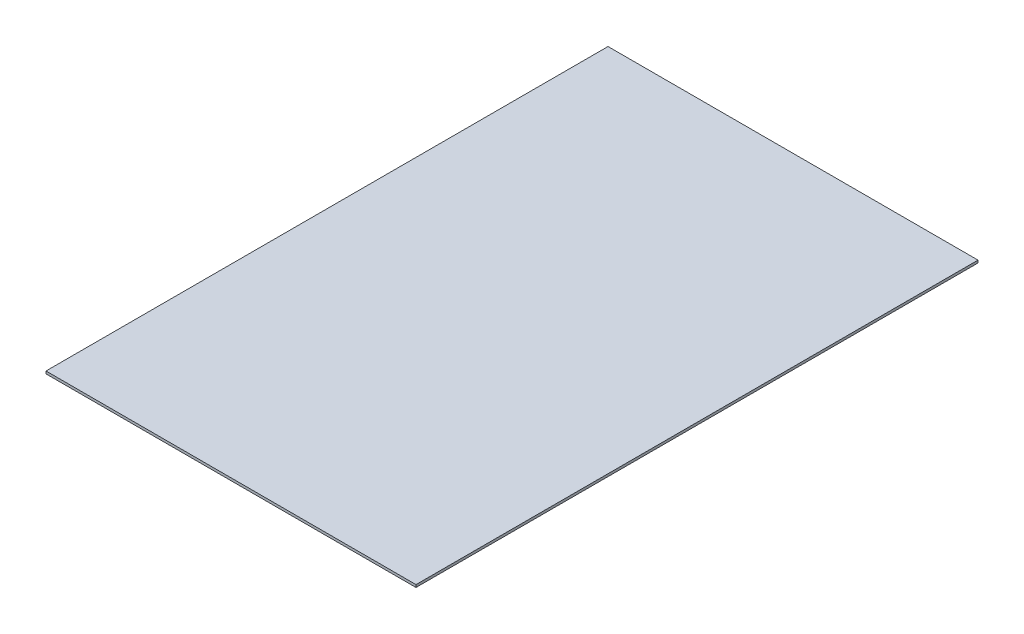
ISO-10303-21;
HEADER;
FILE_DESCRIPTION(('STEP AP214'),'2;1');
FILE_NAME('part.step','',(''),(''),'','','');
FILE_SCHEMA(('AUTOMOTIVE_DESIGN { 1 0 10303 214 1 1 1 1 }'));
ENDSEC;
DATA;
#1=APPLICATION_CONTEXT('core data for automotive mechanical design processes');
#2=APPLICATION_PROTOCOL_DEFINITION('international standard','automotive_design',2000,#1);
#3=PRODUCT_CONTEXT('',#1,'mechanical');
#4=PRODUCT('Part','Part','',(#3));
#5=PRODUCT_RELATED_PRODUCT_CATEGORY('part','',(#4));
#6=PRODUCT_DEFINITION_FORMATION('','',#4);
#7=PRODUCT_DEFINITION_CONTEXT('part definition',#1,'design');
#8=PRODUCT_DEFINITION('design','',#6,#7);
#9=PRODUCT_DEFINITION_SHAPE('','',#8);
#10=(LENGTH_UNIT() NAMED_UNIT(*) SI_UNIT(.MILLI.,.METRE.));
#11=(NAMED_UNIT(*) PLANE_ANGLE_UNIT() SI_UNIT($,.RADIAN.));
#12=(NAMED_UNIT(*) SI_UNIT($,.STERADIAN.) SOLID_ANGLE_UNIT());
#13=UNCERTAINTY_MEASURE_WITH_UNIT(LENGTH_MEASURE(1.E-05),#10,'distance_accuracy_value','');
#14=(GEOMETRIC_REPRESENTATION_CONTEXT(3) GLOBAL_UNCERTAINTY_ASSIGNED_CONTEXT((#13)) GLOBAL_UNIT_ASSIGNED_CONTEXT((#10,
#11,#12)) REPRESENTATION_CONTEXT('',''));
#15=CARTESIAN_POINT('',(0.,0.,0.));
#16=DIRECTION('',(0.,0.,1.));
#17=DIRECTION('',(1.,0.,0.));
#18=AXIS2_PLACEMENT_3D('',#15,#16,#17);
#19=CARTESIAN_POINT('',(0.,3.,0.));
#20=DIRECTION('',(1.,0.,0.));
#21=DIRECTION('',(0.,0.,-1.));
#22=AXIS2_PLACEMENT_3D('',#19,#20,#21);
#23=PLANE('',#22);
#24=DIRECTION('',(0.,0.,1.));
#25=VECTOR('',#24,1.);
#26=CARTESIAN_POINT('',(0.,0.,0.));
#27=LINE('',#26,#25);
#28=CARTESIAN_POINT('',(0.,0.,-668.38));
#29=VERTEX_POINT('',#28);
#30=CARTESIAN_POINT('',(0.,0.,0.));
#31=VERTEX_POINT('',#30);
#32=EDGE_CURVE('E105',#29,#31,#27,.T.);
#33=ORIENTED_EDGE('',*,*,#32,.T.);
#34=DIRECTION('',(0.,-1.,0.));
#35=VECTOR('',#34,1.);
#36=CARTESIAN_POINT('',(0.,3.,0.));
#37=LINE('',#36,#35);
#38=CARTESIAN_POINT('',(0.,3.,0.));
#39=VERTEX_POINT('',#38);
#40=EDGE_CURVE('E11',#39,#31,#37,.T.);
#41=ORIENTED_EDGE('',*,*,#40,.F.);
#42=DIRECTION('',(0.,0.,1.));
#43=VECTOR('',#42,1.);
#44=CARTESIAN_POINT('',(0.,3.,0.));
#45=LINE('',#44,#43);
#46=CARTESIAN_POINT('',(0.,3.,-668.38));
#47=VERTEX_POINT('',#46);
#48=EDGE_CURVE('E89',#47,#39,#45,.T.);
#49=ORIENTED_EDGE('',*,*,#48,.F.);
#50=DIRECTION('',(0.,-1.,0.));
#51=VECTOR('',#50,1.);
#52=CARTESIAN_POINT('',(0.,3.,-668.38));
#53=LINE('',#52,#51);
#54=EDGE_CURVE('E98',#47,#29,#53,.T.);
#55=ORIENTED_EDGE('',*,*,#54,.T.);
#56=EDGE_LOOP('',(#33,#41,#49,#55));
#57=FACE_BOUND('',#56,.T.);
#58=ADVANCED_FACE('F39',(#57),#23,.F.);
#59=CARTESIAN_POINT('',(0.,3.,0.));
#60=DIRECTION('',(0.,0.,-1.));
#61=DIRECTION('',(-1.,0.,0.));
#62=AXIS2_PLACEMENT_3D('',#59,#60,#61);
#63=PLANE('',#62);
#64=DIRECTION('',(1.,0.,0.));
#65=VECTOR('',#64,1.);
#66=CARTESIAN_POINT('',(0.,0.,0.));
#67=LINE('',#66,#65);
#68=CARTESIAN_POINT('',(440.,0.,0.));
#69=VERTEX_POINT('',#68);
#70=EDGE_CURVE('E94',#31,#69,#67,.T.);
#71=ORIENTED_EDGE('',*,*,#70,.T.);
#72=DIRECTION('',(0.,-1.,0.));
#73=VECTOR('',#72,1.);
#74=CARTESIAN_POINT('',(440.,3.,0.));
#75=LINE('',#74,#73);
#76=CARTESIAN_POINT('',(440.,3.,0.));
#77=VERTEX_POINT('',#76);
#78=EDGE_CURVE('E50',#77,#69,#75,.T.);
#79=ORIENTED_EDGE('',*,*,#78,.F.);
#80=DIRECTION('',(1.,0.,0.));
#81=VECTOR('',#80,1.);
#82=CARTESIAN_POINT('',(0.,3.,0.));
#83=LINE('',#82,#81);
#84=EDGE_CURVE('E83',#39,#77,#83,.T.);
#85=ORIENTED_EDGE('',*,*,#84,.F.);
#86=ORIENTED_EDGE('',*,*,#40,.T.);
#87=EDGE_LOOP('',(#71,#79,#85,#86));
#88=FACE_BOUND('',#87,.T.);
#89=ADVANCED_FACE('F91',(#88),#63,.F.);
#90=CARTESIAN_POINT('',(440.,3.,0.));
#91=DIRECTION('',(-1.,0.,0.));
#92=DIRECTION('',(0.,0.,1.));
#93=AXIS2_PLACEMENT_3D('',#90,#91,#92);
#94=PLANE('',#93);
#95=DIRECTION('',(0.,0.,-1.));
#96=VECTOR('',#95,1.);
#97=CARTESIAN_POINT('',(440.,0.,0.));
#98=LINE('',#97,#96);
#99=CARTESIAN_POINT('',(440.,0.,-668.38));
#100=VERTEX_POINT('',#99);
#101=EDGE_CURVE('E75',#69,#100,#98,.T.);
#102=ORIENTED_EDGE('',*,*,#101,.T.);
#103=DIRECTION('',(0.,-1.,0.));
#104=VECTOR('',#103,1.);
#105=CARTESIAN_POINT('',(440.,3.,-668.38));
#106=LINE('',#105,#104);
#107=CARTESIAN_POINT('',(440.,3.,-668.38));
#108=VERTEX_POINT('',#107);
#109=EDGE_CURVE('E92',#108,#100,#106,.T.);
#110=ORIENTED_EDGE('',*,*,#109,.F.);
#111=DIRECTION('',(0.,0.,-1.));
#112=VECTOR('',#111,1.);
#113=CARTESIAN_POINT('',(440.,3.,0.));
#114=LINE('',#113,#112);
#115=EDGE_CURVE('E86',#77,#108,#114,.T.);
#116=ORIENTED_EDGE('',*,*,#115,.F.);
#117=ORIENTED_EDGE('',*,*,#78,.T.);
#118=EDGE_LOOP('',(#102,#110,#116,#117));
#119=FACE_BOUND('',#118,.T.);
#120=ADVANCED_FACE('F96',(#119),#94,.F.);
#121=CARTESIAN_POINT('',(0.,3.,-668.38));
#122=DIRECTION('',(0.,0.,1.));
#123=DIRECTION('',(1.,0.,0.));
#124=AXIS2_PLACEMENT_3D('',#121,#122,#123);
#125=PLANE('',#124);
#126=DIRECTION('',(-1.,0.,0.));
#127=VECTOR('',#126,1.);
#128=CARTESIAN_POINT('',(0.,0.,-668.38));
#129=LINE('',#128,#127);
#130=EDGE_CURVE('E79',#100,#29,#129,.T.);
#131=ORIENTED_EDGE('',*,*,#130,.T.);
#132=ORIENTED_EDGE('',*,*,#54,.F.);
#133=DIRECTION('',(-1.,0.,0.));
#134=VECTOR('',#133,1.);
#135=CARTESIAN_POINT('',(0.,3.,-668.38));
#136=LINE('',#135,#134);
#137=EDGE_CURVE('E54',#108,#47,#136,.T.);
#138=ORIENTED_EDGE('',*,*,#137,.F.);
#139=ORIENTED_EDGE('',*,*,#109,.T.);
#140=EDGE_LOOP('',(#131,#132,#138,#139));
#141=FACE_BOUND('',#140,.T.);
#142=ADVANCED_FACE('F108',(#141),#125,.F.);
#143=CARTESIAN_POINT('',(0.,3.,0.));
#144=DIRECTION('',(0.,-1.,0.));
#145=DIRECTION('',(0.,0.,-1.));
#146=AXIS2_PLACEMENT_3D('',#143,#144,#145);
#147=PLANE('',#146);
#148=ORIENTED_EDGE('',*,*,#48,.T.);
#149=ORIENTED_EDGE('',*,*,#84,.T.);
#150=ORIENTED_EDGE('',*,*,#115,.T.);
#151=ORIENTED_EDGE('',*,*,#137,.T.);
#152=EDGE_LOOP('',(#148,#149,#150,#151));
#153=FACE_BOUND('',#152,.T.);
#154=ADVANCED_FACE('F88',(#153),#147,.F.);
#155=CARTESIAN_POINT('',(0.,0.,0.));
#156=DIRECTION('',(0.,-1.,0.));
#157=DIRECTION('',(0.,0.,-1.));
#158=AXIS2_PLACEMENT_3D('',#155,#156,#157);
#159=PLANE('',#158);
#160=ORIENTED_EDGE('',*,*,#32,.F.);
#161=ORIENTED_EDGE('',*,*,#130,.F.);
#162=ORIENTED_EDGE('',*,*,#101,.F.);
#163=ORIENTED_EDGE('',*,*,#70,.F.);
#164=EDGE_LOOP('',(#160,#161,#162,#163));
#165=FACE_BOUND('',#164,.T.);
#166=ADVANCED_FACE('F115',(#165),#159,.T.);
#167=CLOSED_SHELL('',(#58,#89,#120,#142,#154,#166));
#168=MANIFOLD_SOLID_BREP('B2',#167);
#169=ADVANCED_BREP_SHAPE_REPRESENTATION('',(#18,#168),#14);
#170=SHAPE_DEFINITION_REPRESENTATION(#9,#169);
ENDSEC;
END-ISO-10303-21;
